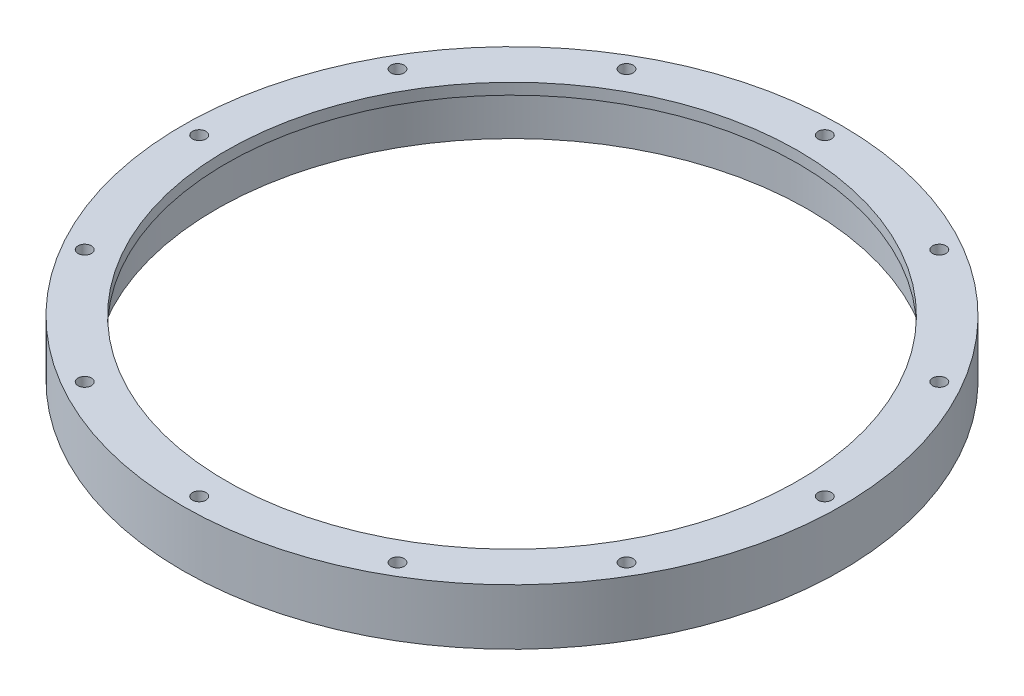
ISO-10303-21;
HEADER;
FILE_DESCRIPTION(('STEP AP214'),'2;1');
FILE_NAME('part.step','',(''),(''),'','','');
FILE_SCHEMA(('AUTOMOTIVE_DESIGN { 1 0 10303 214 1 1 1 1 }'));
ENDSEC;
DATA;
#1=APPLICATION_CONTEXT('core data for automotive mechanical design processes');
#2=APPLICATION_PROTOCOL_DEFINITION('international standard','automotive_design',2000,#1);
#3=PRODUCT_CONTEXT('',#1,'mechanical');
#4=PRODUCT('Part','Part','',(#3));
#5=PRODUCT_RELATED_PRODUCT_CATEGORY('part','',(#4));
#6=PRODUCT_DEFINITION_FORMATION('','',#4);
#7=PRODUCT_DEFINITION_CONTEXT('part definition',#1,'design');
#8=PRODUCT_DEFINITION('design','',#6,#7);
#9=PRODUCT_DEFINITION_SHAPE('','',#8);
#10=(LENGTH_UNIT() NAMED_UNIT(*) SI_UNIT(.MILLI.,.METRE.));
#11=(NAMED_UNIT(*) PLANE_ANGLE_UNIT() SI_UNIT($,.RADIAN.));
#12=(NAMED_UNIT(*) SI_UNIT($,.STERADIAN.) SOLID_ANGLE_UNIT());
#13=UNCERTAINTY_MEASURE_WITH_UNIT(LENGTH_MEASURE(1.E-05),#10,'distance_accuracy_value','');
#14=(GEOMETRIC_REPRESENTATION_CONTEXT(3) GLOBAL_UNCERTAINTY_ASSIGNED_CONTEXT((#13)) GLOBAL_UNIT_ASSIGNED_CONTEXT((#10,
#11,#12)) REPRESENTATION_CONTEXT('',''));
#15=CARTESIAN_POINT('',(0.,0.,0.));
#16=DIRECTION('',(0.,0.,1.));
#17=DIRECTION('',(1.,0.,0.));
#18=AXIS2_PLACEMENT_3D('',#15,#16,#17);
#19=CARTESIAN_POINT('',(0.,0.,0.));
#20=DIRECTION('',(0.,-1.,0.));
#21=DIRECTION('',(0.,0.,-1.));
#22=AXIS2_PLACEMENT_3D('',#19,#20,#21);
#23=CYLINDRICAL_SURFACE('',#22,53.);
#24=CARTESIAN_POINT('',(0.,8.,0.));
#25=DIRECTION('',(0.,-1.,0.));
#26=DIRECTION('',(0.,0.,-1.));
#27=AXIS2_PLACEMENT_3D('',#24,#25,#26);
#28=CIRCLE('',#27,53.);
#29=CARTESIAN_POINT('',(0.,8.,-53.));
#30=VERTEX_POINT('',#29);
#31=EDGE_CURVE('E56',#30,#30,#28,.T.);
#32=ORIENTED_EDGE('',*,*,#31,.F.);
#33=EDGE_LOOP('',(#32));
#34=FACE_BOUND('',#33,.T.);
#35=CARTESIAN_POINT('',(0.,0.,0.));
#36=DIRECTION('',(0.,-1.,0.));
#37=DIRECTION('',(0.,0.,-1.));
#38=AXIS2_PLACEMENT_3D('',#35,#36,#37);
#39=CIRCLE('',#38,53.);
#40=CARTESIAN_POINT('',(0.,0.,-53.));
#41=VERTEX_POINT('',#40);
#42=EDGE_CURVE('E10',#41,#41,#39,.T.);
#43=ORIENTED_EDGE('',*,*,#42,.T.);
#44=EDGE_LOOP('',(#43));
#45=FACE_BOUND('',#44,.T.);
#46=ADVANCED_FACE('F34',(#34,#45),#23,.F.);
#47=CARTESIAN_POINT('',(-53.,0.,0.));
#48=DIRECTION('',(0.,1.,0.));
#49=DIRECTION('',(0.,0.,1.));
#50=AXIS2_PLACEMENT_3D('',#47,#48,#49);
#51=PLANE('',#50);
#52=CARTESIAN_POINT('',(-48.4974226119286,0.,27.9999999999999));
#53=DIRECTION('',(0.,-1.,0.));
#54=DIRECTION('',(0.86602540378444,0.,-0.499999999999998));
#55=AXIS2_PLACEMENT_3D('',#52,#53,#54);
#56=CIRCLE('',#55,1.2);
#57=CARTESIAN_POINT('',(-47.4581921273873,0.,27.3999999999999));
#58=VERTEX_POINT('',#57);
#59=EDGE_CURVE('E115',#58,#58,#56,.T.);
#60=ORIENTED_EDGE('',*,*,#59,.F.);
#61=EDGE_LOOP('',(#60));
#62=FACE_BOUND('',#61,.T.);
#63=CARTESIAN_POINT('',(-56.,0.,-1.95522954975215E-13));
#64=DIRECTION('',(0.,-1.,0.));
#65=DIRECTION('',(1.,0.,0.));
#66=AXIS2_PLACEMENT_3D('',#63,#64,#65);
#67=CIRCLE('',#66,1.2);
#68=CARTESIAN_POINT('',(-54.8,0.,-1.91333177368604E-13));
#69=VERTEX_POINT('',#68);
#70=EDGE_CURVE('E109',#69,#69,#67,.T.);
#71=ORIENTED_EDGE('',*,*,#70,.F.);
#72=EDGE_LOOP('',(#71));
#73=FACE_BOUND('',#72,.T.);
#74=CARTESIAN_POINT('',(-48.4974226119284,0.,-28.0000000000002));
#75=DIRECTION('',(0.,-1.,0.));
#76=DIRECTION('',(0.866025403784436,0.,0.500000000000004));
#77=AXIS2_PLACEMENT_3D('',#74,#75,#76);
#78=CIRCLE('',#77,1.2);
#79=CARTESIAN_POINT('',(-47.4581921273871,0.,-27.4000000000002));
#80=VERTEX_POINT('',#79);
#81=EDGE_CURVE('E103',#80,#80,#78,.T.);
#82=ORIENTED_EDGE('',*,*,#81,.F.);
#83=EDGE_LOOP('',(#82));
#84=FACE_BOUND('',#83,.T.);
#85=CARTESIAN_POINT('',(-27.9999999999997,0.,-48.4974226119287));
#86=DIRECTION('',(0.,-1.,0.));
#87=DIRECTION('',(0.499999999999995,0.,0.866025403784442));
#88=AXIS2_PLACEMENT_3D('',#85,#86,#87);
#89=CIRCLE('',#88,1.2);
#90=CARTESIAN_POINT('',(-27.3999999999997,0.,-47.4581921273874));
#91=VERTEX_POINT('',#90);
#92=EDGE_CURVE('E97',#91,#91,#89,.T.);
#93=ORIENTED_EDGE('',*,*,#92,.F.);
#94=EDGE_LOOP('',(#93));
#95=FACE_BOUND('',#94,.T.);
#96=CARTESIAN_POINT('',(0.,0.,-56.));
#97=DIRECTION('',(0.,-1.,0.));
#98=DIRECTION('',(0.,0.,1.));
#99=AXIS2_PLACEMENT_3D('',#96,#97,#98);
#100=CIRCLE('',#99,1.2);
#101=CARTESIAN_POINT('',(0.,0.,-54.8));
#102=VERTEX_POINT('',#101);
#103=EDGE_CURVE('E91',#102,#102,#100,.T.);
#104=ORIENTED_EDGE('',*,*,#103,.F.);
#105=EDGE_LOOP('',(#104));
#106=FACE_BOUND('',#105,.T.);
#107=CARTESIAN_POINT('',(28.0000000000004,0.,-48.4974226119283));
#108=DIRECTION('',(0.,-1.,0.));
#109=DIRECTION('',(-0.500000000000007,0.,0.866025403784435));
#110=AXIS2_PLACEMENT_3D('',#107,#108,#109);
#111=CIRCLE('',#110,1.2);
#112=CARTESIAN_POINT('',(27.4000000000004,0.,-47.458192127387));
#113=VERTEX_POINT('',#112);
#114=EDGE_CURVE('E85',#113,#113,#111,.T.);
#115=ORIENTED_EDGE('',*,*,#114,.F.);
#116=EDGE_LOOP('',(#115));
#117=FACE_BOUND('',#116,.T.);
#118=CARTESIAN_POINT('',(48.4974226119288,0.,-27.9999999999995));
#119=DIRECTION('',(0.,-1.,0.));
#120=DIRECTION('',(-0.866025403784443,0.,0.499999999999992));
#121=AXIS2_PLACEMENT_3D('',#118,#119,#120);
#122=CIRCLE('',#121,1.2);
#123=CARTESIAN_POINT('',(47.4581921273875,0.,-27.3999999999996));
#124=VERTEX_POINT('',#123);
#125=EDGE_CURVE('E79',#124,#124,#122,.T.);
#126=ORIENTED_EDGE('',*,*,#125,.F.);
#127=EDGE_LOOP('',(#126));
#128=FACE_BOUND('',#127,.T.);
#129=CARTESIAN_POINT('',(56.,0.,5.86568864925646E-13));
#130=DIRECTION('',(0.,-1.,0.));
#131=DIRECTION('',(-1.,0.,0.));
#132=AXIS2_PLACEMENT_3D('',#129,#130,#131);
#133=CIRCLE('',#132,1.2);
#134=CARTESIAN_POINT('',(54.8,0.,5.73999532105811E-13));
#135=VERTEX_POINT('',#134);
#136=EDGE_CURVE('E72',#135,#135,#133,.T.);
#137=ORIENTED_EDGE('',*,*,#136,.F.);
#138=EDGE_LOOP('',(#137));
#139=FACE_BOUND('',#138,.T.);
#140=CARTESIAN_POINT('',(48.4974226119282,0.,28.0000000000006));
#141=DIRECTION('',(0.,-1.,0.));
#142=DIRECTION('',(-0.866025403784433,0.,-0.50000000000001));
#143=AXIS2_PLACEMENT_3D('',#140,#141,#142);
#144=CIRCLE('',#143,1.2);
#145=CARTESIAN_POINT('',(47.4581921273869,0.,27.4000000000006));
#146=VERTEX_POINT('',#145);
#147=EDGE_CURVE('E126',#146,#146,#144,.T.);
#148=ORIENTED_EDGE('',*,*,#147,.F.);
#149=EDGE_LOOP('',(#148));
#150=FACE_BOUND('',#149,.T.);
#151=CARTESIAN_POINT('',(27.9999999999994,0.,48.4974226119289));
#152=DIRECTION('',(0.,-1.,0.));
#153=DIRECTION('',(-0.499999999999989,0.,-0.866025403784445));
#154=AXIS2_PLACEMENT_3D('',#151,#152,#153);
#155=CIRCLE('',#154,1.2);
#156=CARTESIAN_POINT('',(27.3999999999994,0.,47.4581921273876));
#157=VERTEX_POINT('',#156);
#158=EDGE_CURVE('E120',#157,#157,#155,.T.);
#159=ORIENTED_EDGE('',*,*,#158,.F.);
#160=EDGE_LOOP('',(#159));
#161=FACE_BOUND('',#160,.T.);
#162=CARTESIAN_POINT('',(-28.0000000000001,0.,48.4974226119285));
#163=DIRECTION('',(0.,-1.,0.));
#164=DIRECTION('',(0.500000000000001,0.,-0.866025403784438));
#165=AXIS2_PLACEMENT_3D('',#162,#163,#164);
#166=CIRCLE('',#165,1.2);
#167=CARTESIAN_POINT('',(-27.4000000000001,0.,47.4581921273872));
#168=VERTEX_POINT('',#167);
#169=EDGE_CURVE('E66',#168,#168,#166,.T.);
#170=ORIENTED_EDGE('',*,*,#169,.F.);
#171=EDGE_LOOP('',(#170));
#172=FACE_BOUND('',#171,.T.);
#173=CARTESIAN_POINT('',(0.,0.,56.));
#174=DIRECTION('',(0.,-1.,0.));
#175=DIRECTION('',(0.,0.,-1.));
#176=AXIS2_PLACEMENT_3D('',#173,#174,#175);
#177=CIRCLE('',#176,1.2);
#178=CARTESIAN_POINT('',(0.,0.,54.8));
#179=VERTEX_POINT('',#178);
#180=EDGE_CURVE('E60',#179,#179,#177,.T.);
#181=ORIENTED_EDGE('',*,*,#180,.F.);
#182=EDGE_LOOP('',(#181));
#183=FACE_BOUND('',#182,.T.);
#184=ORIENTED_EDGE('',*,*,#42,.F.);
#185=EDGE_LOOP('',(#184));
#186=FACE_BOUND('',#185,.T.);
#187=CARTESIAN_POINT('',(0.,0.,0.));
#188=DIRECTION('',(0.,-1.,0.));
#189=DIRECTION('',(0.,0.,-1.));
#190=AXIS2_PLACEMENT_3D('',#187,#188,#189);
#191=CIRCLE('',#190,59.);
#192=CARTESIAN_POINT('',(0.,0.,-59.));
#193=VERTEX_POINT('',#192);
#194=EDGE_CURVE('E40',#193,#193,#191,.T.);
#195=ORIENTED_EDGE('',*,*,#194,.T.);
#196=EDGE_LOOP('',(#195));
#197=FACE_BOUND('',#196,.T.);
#198=ADVANCED_FACE('F143',(#62,#73,#84,#95,#106,#117,#128,#139,#150,#161,#172,#183,#186,#197),
#51,.F.);
#199=CARTESIAN_POINT('',(0.,0.,0.));
#200=DIRECTION('',(0.,-1.,0.));
#201=DIRECTION('',(0.,0.,-1.));
#202=AXIS2_PLACEMENT_3D('',#199,#200,#201);
#203=CYLINDRICAL_SURFACE('',#202,59.);
#204=ORIENTED_EDGE('',*,*,#194,.F.);
#205=EDGE_LOOP('',(#204));
#206=FACE_BOUND('',#205,.T.);
#207=CARTESIAN_POINT('',(0.,10.,0.));
#208=DIRECTION('',(0.,-1.,0.));
#209=DIRECTION('',(0.,0.,-1.));
#210=AXIS2_PLACEMENT_3D('',#207,#208,#209);
#211=CIRCLE('',#210,59.);
#212=CARTESIAN_POINT('',(0.,10.,-59.));
#213=VERTEX_POINT('',#212);
#214=EDGE_CURVE('E44',#213,#213,#211,.T.);
#215=ORIENTED_EDGE('',*,*,#214,.T.);
#216=EDGE_LOOP('',(#215));
#217=FACE_BOUND('',#216,.T.);
#218=ADVANCED_FACE('F146',(#206,#217),#203,.T.);
#219=CARTESIAN_POINT('',(-59.,10.,0.));
#220=DIRECTION('',(0.,-1.,0.));
#221=DIRECTION('',(0.,0.,-1.));
#222=AXIS2_PLACEMENT_3D('',#219,#220,#221);
#223=PLANE('',#222);
#224=CARTESIAN_POINT('',(-48.4974226119286,10.,27.9999999999999));
#225=DIRECTION('',(0.,-1.,0.));
#226=DIRECTION('',(0.86602540378444,0.,-0.499999999999998));
#227=AXIS2_PLACEMENT_3D('',#224,#225,#226);
#228=CIRCLE('',#227,1.2);
#229=CARTESIAN_POINT('',(-47.4581921273873,10.,27.3999999999999));
#230=VERTEX_POINT('',#229);
#231=EDGE_CURVE('E69',#230,#230,#228,.T.);
#232=ORIENTED_EDGE('',*,*,#231,.T.);
#233=EDGE_LOOP('',(#232));
#234=FACE_BOUND('',#233,.T.);
#235=CARTESIAN_POINT('',(-56.,10.,-1.95522954975215E-13));
#236=DIRECTION('',(0.,-1.,0.));
#237=DIRECTION('',(1.,0.,0.));
#238=AXIS2_PLACEMENT_3D('',#235,#236,#237);
#239=CIRCLE('',#238,1.2);
#240=CARTESIAN_POINT('',(-54.8,10.,-1.91333177368604E-13));
#241=VERTEX_POINT('',#240);
#242=EDGE_CURVE('E112',#241,#241,#239,.T.);
#243=ORIENTED_EDGE('',*,*,#242,.T.);
#244=EDGE_LOOP('',(#243));
#245=FACE_BOUND('',#244,.T.);
#246=CARTESIAN_POINT('',(-48.4974226119284,10.,-28.0000000000002));
#247=DIRECTION('',(0.,-1.,0.));
#248=DIRECTION('',(0.866025403784436,0.,0.500000000000004));
#249=AXIS2_PLACEMENT_3D('',#246,#247,#248);
#250=CIRCLE('',#249,1.2);
#251=CARTESIAN_POINT('',(-47.4581921273871,10.,-27.4000000000002));
#252=VERTEX_POINT('',#251);
#253=EDGE_CURVE('E106',#252,#252,#250,.T.);
#254=ORIENTED_EDGE('',*,*,#253,.T.);
#255=EDGE_LOOP('',(#254));
#256=FACE_BOUND('',#255,.T.);
#257=CARTESIAN_POINT('',(-27.9999999999997,10.,-48.4974226119287));
#258=DIRECTION('',(0.,-1.,0.));
#259=DIRECTION('',(0.499999999999995,0.,0.866025403784442));
#260=AXIS2_PLACEMENT_3D('',#257,#258,#259);
#261=CIRCLE('',#260,1.2);
#262=CARTESIAN_POINT('',(-27.3999999999997,10.,-47.4581921273874));
#263=VERTEX_POINT('',#262);
#264=EDGE_CURVE('E100',#263,#263,#261,.T.);
#265=ORIENTED_EDGE('',*,*,#264,.T.);
#266=EDGE_LOOP('',(#265));
#267=FACE_BOUND('',#266,.T.);
#268=CARTESIAN_POINT('',(0.,10.,-56.));
#269=DIRECTION('',(0.,-1.,0.));
#270=DIRECTION('',(0.,0.,1.));
#271=AXIS2_PLACEMENT_3D('',#268,#269,#270);
#272=CIRCLE('',#271,1.2);
#273=CARTESIAN_POINT('',(0.,10.,-54.8));
#274=VERTEX_POINT('',#273);
#275=EDGE_CURVE('E94',#274,#274,#272,.T.);
#276=ORIENTED_EDGE('',*,*,#275,.T.);
#277=EDGE_LOOP('',(#276));
#278=FACE_BOUND('',#277,.T.);
#279=CARTESIAN_POINT('',(28.0000000000004,10.,-48.4974226119283));
#280=DIRECTION('',(0.,-1.,0.));
#281=DIRECTION('',(-0.500000000000007,0.,0.866025403784435));
#282=AXIS2_PLACEMENT_3D('',#279,#280,#281);
#283=CIRCLE('',#282,1.2);
#284=CARTESIAN_POINT('',(27.4000000000004,10.,-47.458192127387));
#285=VERTEX_POINT('',#284);
#286=EDGE_CURVE('E88',#285,#285,#283,.T.);
#287=ORIENTED_EDGE('',*,*,#286,.T.);
#288=EDGE_LOOP('',(#287));
#289=FACE_BOUND('',#288,.T.);
#290=CARTESIAN_POINT('',(48.4974226119288,10.,-27.9999999999995));
#291=DIRECTION('',(0.,-1.,0.));
#292=DIRECTION('',(-0.866025403784443,0.,0.499999999999992));
#293=AXIS2_PLACEMENT_3D('',#290,#291,#292);
#294=CIRCLE('',#293,1.2);
#295=CARTESIAN_POINT('',(47.4581921273875,10.,-27.3999999999996));
#296=VERTEX_POINT('',#295);
#297=EDGE_CURVE('E82',#296,#296,#294,.T.);
#298=ORIENTED_EDGE('',*,*,#297,.T.);
#299=EDGE_LOOP('',(#298));
#300=FACE_BOUND('',#299,.T.);
#301=CARTESIAN_POINT('',(56.,10.,5.86568864925646E-13));
#302=DIRECTION('',(0.,-1.,0.));
#303=DIRECTION('',(-1.,0.,0.));
#304=AXIS2_PLACEMENT_3D('',#301,#302,#303);
#305=CIRCLE('',#304,1.2);
#306=CARTESIAN_POINT('',(54.8,10.,5.73999532105811E-13));
#307=VERTEX_POINT('',#306);
#308=EDGE_CURVE('E75',#307,#307,#305,.T.);
#309=ORIENTED_EDGE('',*,*,#308,.T.);
#310=EDGE_LOOP('',(#309));
#311=FACE_BOUND('',#310,.T.);
#312=CARTESIAN_POINT('',(48.4974226119282,10.,28.0000000000006));
#313=DIRECTION('',(0.,-1.,0.));
#314=DIRECTION('',(-0.866025403784433,0.,-0.50000000000001));
#315=AXIS2_PLACEMENT_3D('',#312,#313,#314);
#316=CIRCLE('',#315,1.2);
#317=CARTESIAN_POINT('',(47.4581921273869,10.,27.4000000000006));
#318=VERTEX_POINT('',#317);
#319=EDGE_CURVE('E76',#318,#318,#316,.T.);
#320=ORIENTED_EDGE('',*,*,#319,.T.);
#321=EDGE_LOOP('',(#320));
#322=FACE_BOUND('',#321,.T.);
#323=CARTESIAN_POINT('',(27.9999999999994,10.,48.4974226119289));
#324=DIRECTION('',(0.,-1.,0.));
#325=DIRECTION('',(-0.499999999999989,0.,-0.866025403784445));
#326=AXIS2_PLACEMENT_3D('',#323,#324,#325);
#327=CIRCLE('',#326,1.2);
#328=CARTESIAN_POINT('',(27.3999999999994,10.,47.4581921273876));
#329=VERTEX_POINT('',#328);
#330=EDGE_CURVE('E123',#329,#329,#327,.T.);
#331=ORIENTED_EDGE('',*,*,#330,.T.);
#332=EDGE_LOOP('',(#331));
#333=FACE_BOUND('',#332,.T.);
#334=CARTESIAN_POINT('',(-28.0000000000001,10.,48.4974226119285));
#335=DIRECTION('',(0.,-1.,0.));
#336=DIRECTION('',(0.500000000000001,0.,-0.866025403784438));
#337=AXIS2_PLACEMENT_3D('',#334,#335,#336);
#338=CIRCLE('',#337,1.2);
#339=CARTESIAN_POINT('',(-27.4000000000001,10.,47.4581921273872));
#340=VERTEX_POINT('',#339);
#341=EDGE_CURVE('E63',#340,#340,#338,.T.);
#342=ORIENTED_EDGE('',*,*,#341,.T.);
#343=EDGE_LOOP('',(#342));
#344=FACE_BOUND('',#343,.T.);
#345=CARTESIAN_POINT('',(0.,10.,56.));
#346=DIRECTION('',(0.,-1.,0.));
#347=DIRECTION('',(0.,0.,-1.));
#348=AXIS2_PLACEMENT_3D('',#345,#346,#347);
#349=CIRCLE('',#348,1.2);
#350=CARTESIAN_POINT('',(0.,10.,54.8));
#351=VERTEX_POINT('',#350);
#352=EDGE_CURVE('E59',#351,#351,#349,.T.);
#353=ORIENTED_EDGE('',*,*,#352,.T.);
#354=EDGE_LOOP('',(#353));
#355=FACE_BOUND('',#354,.T.);
#356=ORIENTED_EDGE('',*,*,#214,.F.);
#357=EDGE_LOOP('',(#356));
#358=FACE_BOUND('',#357,.T.);
#359=CARTESIAN_POINT('',(0.,10.,0.));
#360=DIRECTION('',(0.,-1.,0.));
#361=DIRECTION('',(0.,0.,-1.));
#362=AXIS2_PLACEMENT_3D('',#359,#360,#361);
#363=CIRCLE('',#362,51.2);
#364=CARTESIAN_POINT('',(0.,10.,-51.2));
#365=VERTEX_POINT('',#364);
#366=EDGE_CURVE('E48',#365,#365,#363,.T.);
#367=ORIENTED_EDGE('',*,*,#366,.T.);
#368=EDGE_LOOP('',(#367));
#369=FACE_BOUND('',#368,.T.);
#370=ADVANCED_FACE('F132',(#234,#245,#256,#267,#278,#289,#300,#311,#322,#333,#344,#355,#358,
#369),#223,.F.);
#371=CARTESIAN_POINT('',(0.,0.,0.));
#372=DIRECTION('',(0.,-1.,0.));
#373=DIRECTION('',(0.,0.,-1.));
#374=AXIS2_PLACEMENT_3D('',#371,#372,#373);
#375=CYLINDRICAL_SURFACE('',#374,51.2);
#376=ORIENTED_EDGE('',*,*,#366,.F.);
#377=EDGE_LOOP('',(#376));
#378=FACE_BOUND('',#377,.T.);
#379=CARTESIAN_POINT('',(0.,8.,0.));
#380=DIRECTION('',(0.,-1.,0.));
#381=DIRECTION('',(0.,0.,-1.));
#382=AXIS2_PLACEMENT_3D('',#379,#380,#381);
#383=CIRCLE('',#382,51.2);
#384=CARTESIAN_POINT('',(0.,8.,-51.2));
#385=VERTEX_POINT('',#384);
#386=EDGE_CURVE('E53',#385,#385,#383,.T.);
#387=ORIENTED_EDGE('',*,*,#386,.T.);
#388=EDGE_LOOP('',(#387));
#389=FACE_BOUND('',#388,.T.);
#390=ADVANCED_FACE('F167',(#378,#389),#375,.F.);
#391=CARTESIAN_POINT('',(-51.2,8.,0.));
#392=DIRECTION('',(0.,1.,0.));
#393=DIRECTION('',(0.,0.,1.));
#394=AXIS2_PLACEMENT_3D('',#391,#392,#393);
#395=PLANE('',#394);
#396=ORIENTED_EDGE('',*,*,#386,.F.);
#397=EDGE_LOOP('',(#396));
#398=FACE_BOUND('',#397,.T.);
#399=ORIENTED_EDGE('',*,*,#31,.T.);
#400=EDGE_LOOP('',(#399));
#401=FACE_BOUND('',#400,.T.);
#402=ADVANCED_FACE('F158',(#398,#401),#395,.F.);
#403=CARTESIAN_POINT('',(0.,10.,56.));
#404=DIRECTION('',(0.,-1.,0.));
#405=DIRECTION('',(0.,0.,-1.));
#406=AXIS2_PLACEMENT_3D('',#403,#404,#405);
#407=CYLINDRICAL_SURFACE('',#406,1.2);
#408=ORIENTED_EDGE('',*,*,#352,.F.);
#409=EDGE_LOOP('',(#408));
#410=FACE_BOUND('',#409,.T.);
#411=ORIENTED_EDGE('',*,*,#180,.T.);
#412=EDGE_LOOP('',(#411));
#413=FACE_BOUND('',#412,.T.);
#414=ADVANCED_FACE('F155',(#410,#413),#407,.F.);
#415=CARTESIAN_POINT('',(-28.0000000000001,10.,48.4974226119285));
#416=DIRECTION('',(0.,-1.,0.));
#417=DIRECTION('',(0.,0.,-1.));
#418=AXIS2_PLACEMENT_3D('',#415,#416,#417);
#419=CYLINDRICAL_SURFACE('',#418,1.2);
#420=ORIENTED_EDGE('',*,*,#341,.F.);
#421=EDGE_LOOP('',(#420));
#422=FACE_BOUND('',#421,.T.);
#423=ORIENTED_EDGE('',*,*,#169,.T.);
#424=EDGE_LOOP('',(#423));
#425=FACE_BOUND('',#424,.T.);
#426=ADVANCED_FACE('F157',(#422,#425),#419,.F.);
#427=CARTESIAN_POINT('',(27.9999999999994,10.,48.4974226119289));
#428=DIRECTION('',(0.,-1.,0.));
#429=DIRECTION('',(0.,0.,-1.));
#430=AXIS2_PLACEMENT_3D('',#427,#428,#429);
#431=CYLINDRICAL_SURFACE('',#430,1.2);
#432=ORIENTED_EDGE('',*,*,#330,.F.);
#433=EDGE_LOOP('',(#432));
#434=FACE_BOUND('',#433,.T.);
#435=ORIENTED_EDGE('',*,*,#158,.T.);
#436=EDGE_LOOP('',(#435));
#437=FACE_BOUND('',#436,.T.);
#438=ADVANCED_FACE('F139',(#434,#437),#431,.F.);
#439=CARTESIAN_POINT('',(48.4974226119282,10.,28.0000000000006));
#440=DIRECTION('',(0.,-1.,0.));
#441=DIRECTION('',(0.,0.,-1.));
#442=AXIS2_PLACEMENT_3D('',#439,#440,#441);
#443=CYLINDRICAL_SURFACE('',#442,1.2);
#444=ORIENTED_EDGE('',*,*,#319,.F.);
#445=EDGE_LOOP('',(#444));
#446=FACE_BOUND('',#445,.T.);
#447=ORIENTED_EDGE('',*,*,#147,.T.);
#448=EDGE_LOOP('',(#447));
#449=FACE_BOUND('',#448,.T.);
#450=ADVANCED_FACE('F135',(#446,#449),#443,.F.);
#451=CARTESIAN_POINT('',(56.,10.,5.86568864925646E-13));
#452=DIRECTION('',(0.,-1.,0.));
#453=DIRECTION('',(0.,0.,-1.));
#454=AXIS2_PLACEMENT_3D('',#451,#452,#453);
#455=CYLINDRICAL_SURFACE('',#454,1.2);
#456=ORIENTED_EDGE('',*,*,#308,.F.);
#457=EDGE_LOOP('',(#456));
#458=FACE_BOUND('',#457,.T.);
#459=ORIENTED_EDGE('',*,*,#136,.T.);
#460=EDGE_LOOP('',(#459));
#461=FACE_BOUND('',#460,.T.);
#462=ADVANCED_FACE('F138',(#458,#461),#455,.F.);
#463=CARTESIAN_POINT('',(48.4974226119288,10.,-27.9999999999995));
#464=DIRECTION('',(0.,-1.,0.));
#465=DIRECTION('',(0.,0.,-1.));
#466=AXIS2_PLACEMENT_3D('',#463,#464,#465);
#467=CYLINDRICAL_SURFACE('',#466,1.2);
#468=ORIENTED_EDGE('',*,*,#297,.F.);
#469=EDGE_LOOP('',(#468));
#470=FACE_BOUND('',#469,.T.);
#471=ORIENTED_EDGE('',*,*,#125,.T.);
#472=EDGE_LOOP('',(#471));
#473=FACE_BOUND('',#472,.T.);
#474=ADVANCED_FACE('F229',(#470,#473),#467,.F.);
#475=CARTESIAN_POINT('',(28.0000000000004,10.,-48.4974226119283));
#476=DIRECTION('',(0.,-1.,0.));
#477=DIRECTION('',(0.,0.,-1.));
#478=AXIS2_PLACEMENT_3D('',#475,#476,#477);
#479=CYLINDRICAL_SURFACE('',#478,1.2);
#480=ORIENTED_EDGE('',*,*,#286,.F.);
#481=EDGE_LOOP('',(#480));
#482=FACE_BOUND('',#481,.T.);
#483=ORIENTED_EDGE('',*,*,#114,.T.);
#484=EDGE_LOOP('',(#483));
#485=FACE_BOUND('',#484,.T.);
#486=ADVANCED_FACE('F245',(#482,#485),#479,.F.);
#487=CARTESIAN_POINT('',(0.,10.,-56.));
#488=DIRECTION('',(0.,-1.,0.));
#489=DIRECTION('',(0.,0.,-1.));
#490=AXIS2_PLACEMENT_3D('',#487,#488,#489);
#491=CYLINDRICAL_SURFACE('',#490,1.2);
#492=ORIENTED_EDGE('',*,*,#275,.F.);
#493=EDGE_LOOP('',(#492));
#494=FACE_BOUND('',#493,.T.);
#495=ORIENTED_EDGE('',*,*,#103,.T.);
#496=EDGE_LOOP('',(#495));
#497=FACE_BOUND('',#496,.T.);
#498=ADVANCED_FACE('F262',(#494,#497),#491,.F.);
#499=CARTESIAN_POINT('',(-27.9999999999997,10.,-48.4974226119287));
#500=DIRECTION('',(0.,-1.,0.));
#501=DIRECTION('',(0.,0.,-1.));
#502=AXIS2_PLACEMENT_3D('',#499,#500,#501);
#503=CYLINDRICAL_SURFACE('',#502,1.2);
#504=ORIENTED_EDGE('',*,*,#264,.F.);
#505=EDGE_LOOP('',(#504));
#506=FACE_BOUND('',#505,.T.);
#507=ORIENTED_EDGE('',*,*,#92,.T.);
#508=EDGE_LOOP('',(#507));
#509=FACE_BOUND('',#508,.T.);
#510=ADVANCED_FACE('F272',(#506,#509),#503,.F.);
#511=CARTESIAN_POINT('',(-48.4974226119284,10.,-28.0000000000002));
#512=DIRECTION('',(0.,-1.,0.));
#513=DIRECTION('',(0.,0.,-1.));
#514=AXIS2_PLACEMENT_3D('',#511,#512,#513);
#515=CYLINDRICAL_SURFACE('',#514,1.2);
#516=ORIENTED_EDGE('',*,*,#253,.F.);
#517=EDGE_LOOP('',(#516));
#518=FACE_BOUND('',#517,.T.);
#519=ORIENTED_EDGE('',*,*,#81,.T.);
#520=EDGE_LOOP('',(#519));
#521=FACE_BOUND('',#520,.T.);
#522=ADVANCED_FACE('F282',(#518,#521),#515,.F.);
#523=CARTESIAN_POINT('',(-56.,10.,-1.95522954975215E-13));
#524=DIRECTION('',(0.,-1.,0.));
#525=DIRECTION('',(0.,0.,-1.));
#526=AXIS2_PLACEMENT_3D('',#523,#524,#525);
#527=CYLINDRICAL_SURFACE('',#526,1.2);
#528=ORIENTED_EDGE('',*,*,#242,.F.);
#529=EDGE_LOOP('',(#528));
#530=FACE_BOUND('',#529,.T.);
#531=ORIENTED_EDGE('',*,*,#70,.T.);
#532=EDGE_LOOP('',(#531));
#533=FACE_BOUND('',#532,.T.);
#534=ADVANCED_FACE('F292',(#530,#533),#527,.F.);
#535=CARTESIAN_POINT('',(-48.4974226119286,10.,27.9999999999999));
#536=DIRECTION('',(0.,-1.,0.));
#537=DIRECTION('',(0.,0.,-1.));
#538=AXIS2_PLACEMENT_3D('',#535,#536,#537);
#539=CYLINDRICAL_SURFACE('',#538,1.2);
#540=ORIENTED_EDGE('',*,*,#231,.F.);
#541=EDGE_LOOP('',(#540));
#542=FACE_BOUND('',#541,.T.);
#543=ORIENTED_EDGE('',*,*,#59,.T.);
#544=EDGE_LOOP('',(#543));
#545=FACE_BOUND('',#544,.T.);
#546=ADVANCED_FACE('F302',(#542,#545),#539,.F.);
#547=CLOSED_SHELL('',(#46,#198,#218,#370,#390,#402,#414,#426,#438,#450,#462,#474,#486,#498,#510,
#522,#534,#546));
#548=MANIFOLD_SOLID_BREP('B2',#547);
#549=ADVANCED_BREP_SHAPE_REPRESENTATION('',(#18,#548),#14);
#550=SHAPE_DEFINITION_REPRESENTATION(#9,#549);
ENDSEC;
END-ISO-10303-21;
